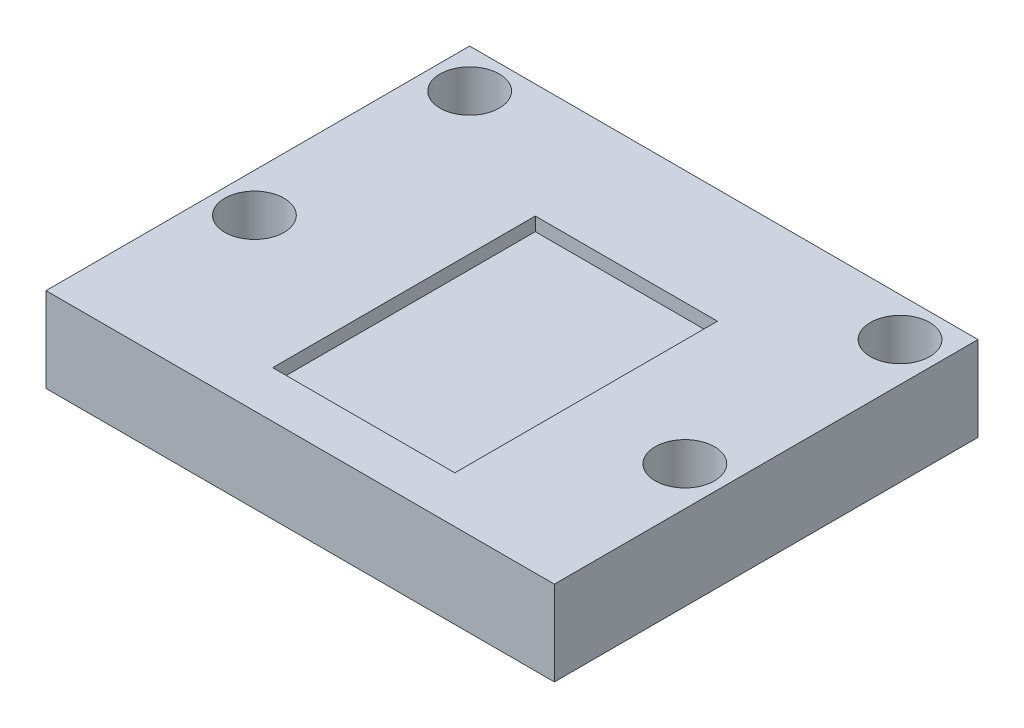
ISO-10303-21;
HEADER;
FILE_DESCRIPTION(('STEP AP214'),'2;1');
FILE_NAME('part.step','',(''),(''),'','','');
FILE_SCHEMA(('AUTOMOTIVE_DESIGN { 1 0 10303 214 1 1 1 1 }'));
ENDSEC;
DATA;
#1=APPLICATION_CONTEXT('core data for automotive mechanical design processes');
#2=APPLICATION_PROTOCOL_DEFINITION('international standard','automotive_design',2000,#1);
#3=PRODUCT_CONTEXT('',#1,'mechanical');
#4=PRODUCT('Part','Part','',(#3));
#5=PRODUCT_RELATED_PRODUCT_CATEGORY('part','',(#4));
#6=PRODUCT_DEFINITION_FORMATION('','',#4);
#7=PRODUCT_DEFINITION_CONTEXT('part definition',#1,'design');
#8=PRODUCT_DEFINITION('design','',#6,#7);
#9=PRODUCT_DEFINITION_SHAPE('','',#8);
#10=(LENGTH_UNIT() NAMED_UNIT(*) SI_UNIT(.MILLI.,.METRE.));
#11=(NAMED_UNIT(*) PLANE_ANGLE_UNIT() SI_UNIT($,.RADIAN.));
#12=(NAMED_UNIT(*) SI_UNIT($,.STERADIAN.) SOLID_ANGLE_UNIT());
#13=UNCERTAINTY_MEASURE_WITH_UNIT(LENGTH_MEASURE(1.E-05),#10,'distance_accuracy_value','');
#14=(GEOMETRIC_REPRESENTATION_CONTEXT(3) GLOBAL_UNCERTAINTY_ASSIGNED_CONTEXT((#13)) GLOBAL_UNIT_ASSIGNED_CONTEXT((#10,
#11,#12)) REPRESENTATION_CONTEXT('',''));
#15=CARTESIAN_POINT('',(0.,0.,0.));
#16=DIRECTION('',(0.,0.,1.));
#17=DIRECTION('',(1.,0.,0.));
#18=AXIS2_PLACEMENT_3D('',#15,#16,#17);
#19=CARTESIAN_POINT('',(0.,10.,0.));
#20=DIRECTION('',(1.,0.,0.));
#21=DIRECTION('',(0.,0.,-1.));
#22=AXIS2_PLACEMENT_3D('',#19,#20,#21);
#23=PLANE('',#22);
#24=DIRECTION('',(0.,0.,1.));
#25=VECTOR('',#24,1.);
#26=CARTESIAN_POINT('',(0.,0.,0.));
#27=LINE('',#26,#25);
#28=CARTESIAN_POINT('',(0.,0.,-50.));
#29=VERTEX_POINT('',#28);
#30=CARTESIAN_POINT('',(0.,0.,0.));
#31=VERTEX_POINT('',#30);
#32=EDGE_CURVE('E195',#29,#31,#27,.T.);
#33=ORIENTED_EDGE('',*,*,#32,.T.);
#34=DIRECTION('',(0.,-1.,0.));
#35=VECTOR('',#34,1.);
#36=CARTESIAN_POINT('',(0.,10.,0.));
#37=LINE('',#36,#35);
#38=CARTESIAN_POINT('',(0.,10.,0.));
#39=VERTEX_POINT('',#38);
#40=EDGE_CURVE('E11',#39,#31,#37,.T.);
#41=ORIENTED_EDGE('',*,*,#40,.F.);
#42=DIRECTION('',(0.,0.,1.));
#43=VECTOR('',#42,1.);
#44=CARTESIAN_POINT('',(0.,10.,0.));
#45=LINE('',#44,#43);
#46=CARTESIAN_POINT('',(0.,10.,-50.));
#47=VERTEX_POINT('',#46);
#48=EDGE_CURVE('E199',#47,#39,#45,.T.);
#49=ORIENTED_EDGE('',*,*,#48,.F.);
#50=DIRECTION('',(0.,-1.,0.));
#51=VECTOR('',#50,1.);
#52=CARTESIAN_POINT('',(0.,10.,-50.));
#53=LINE('',#52,#51);
#54=EDGE_CURVE('E209',#47,#29,#53,.T.);
#55=ORIENTED_EDGE('',*,*,#54,.T.);
#56=EDGE_LOOP('',(#33,#41,#49,#55));
#57=FACE_BOUND('',#56,.T.);
#58=ADVANCED_FACE('F42',(#57),#23,.F.);
#59=CARTESIAN_POINT('',(0.,10.,0.));
#60=DIRECTION('',(0.,0.,-1.));
#61=DIRECTION('',(-1.,0.,0.));
#62=AXIS2_PLACEMENT_3D('',#59,#60,#61);
#63=PLANE('',#62);
#64=DIRECTION('',(1.,0.,0.));
#65=VECTOR('',#64,1.);
#66=CARTESIAN_POINT('',(0.,0.,0.));
#67=LINE('',#66,#65);
#68=CARTESIAN_POINT('',(60.,0.,0.));
#69=VERTEX_POINT('',#68);
#70=EDGE_CURVE('E213',#31,#69,#67,.T.);
#71=ORIENTED_EDGE('',*,*,#70,.T.);
#72=DIRECTION('',(0.,-1.,0.));
#73=VECTOR('',#72,1.);
#74=CARTESIAN_POINT('',(60.,10.,0.));
#75=LINE('',#74,#73);
#76=CARTESIAN_POINT('',(60.,10.,0.));
#77=VERTEX_POINT('',#76);
#78=EDGE_CURVE('E50',#77,#69,#75,.T.);
#79=ORIENTED_EDGE('',*,*,#78,.F.);
#80=DIRECTION('',(1.,0.,0.));
#81=VECTOR('',#80,1.);
#82=CARTESIAN_POINT('',(0.,10.,0.));
#83=LINE('',#82,#81);
#84=EDGE_CURVE('E94',#39,#77,#83,.T.);
#85=ORIENTED_EDGE('',*,*,#84,.F.);
#86=ORIENTED_EDGE('',*,*,#40,.T.);
#87=EDGE_LOOP('',(#71,#79,#85,#86));
#88=FACE_BOUND('',#87,.T.);
#89=ADVANCED_FACE('F248',(#88),#63,.F.);
#90=CARTESIAN_POINT('',(60.,10.,0.));
#91=DIRECTION('',(-1.,0.,0.));
#92=DIRECTION('',(0.,0.,1.));
#93=AXIS2_PLACEMENT_3D('',#90,#91,#92);
#94=PLANE('',#93);
#95=DIRECTION('',(0.,0.,-1.));
#96=VECTOR('',#95,1.);
#97=CARTESIAN_POINT('',(60.,0.,0.));
#98=LINE('',#97,#96);
#99=CARTESIAN_POINT('',(60.,0.,-50.));
#100=VERTEX_POINT('',#99);
#101=EDGE_CURVE('E216',#69,#100,#98,.T.);
#102=ORIENTED_EDGE('',*,*,#101,.T.);
#103=DIRECTION('',(0.,-1.,0.));
#104=VECTOR('',#103,1.);
#105=CARTESIAN_POINT('',(60.,10.,-50.));
#106=LINE('',#105,#104);
#107=CARTESIAN_POINT('',(60.,10.,-50.));
#108=VERTEX_POINT('',#107);
#109=EDGE_CURVE('E223',#108,#100,#106,.T.);
#110=ORIENTED_EDGE('',*,*,#109,.F.);
#111=DIRECTION('',(0.,0.,-1.));
#112=VECTOR('',#111,1.);
#113=CARTESIAN_POINT('',(60.,10.,0.));
#114=LINE('',#113,#112);
#115=EDGE_CURVE('E204',#77,#108,#114,.T.);
#116=ORIENTED_EDGE('',*,*,#115,.F.);
#117=ORIENTED_EDGE('',*,*,#78,.T.);
#118=EDGE_LOOP('',(#102,#110,#116,#117));
#119=FACE_BOUND('',#118,.T.);
#120=ADVANCED_FACE('F230',(#119),#94,.F.);
#121=CARTESIAN_POINT('',(0.,10.,-50.));
#122=DIRECTION('',(0.,0.,1.));
#123=DIRECTION('',(1.,0.,0.));
#124=AXIS2_PLACEMENT_3D('',#121,#122,#123);
#125=PLANE('',#124);
#126=DIRECTION('',(-1.,0.,0.));
#127=VECTOR('',#126,1.);
#128=CARTESIAN_POINT('',(0.,0.,-50.));
#129=LINE('',#128,#127);
#130=EDGE_CURVE('E87',#100,#29,#129,.T.);
#131=ORIENTED_EDGE('',*,*,#130,.T.);
#132=ORIENTED_EDGE('',*,*,#54,.F.);
#133=DIRECTION('',(-1.,0.,0.));
#134=VECTOR('',#133,1.);
#135=CARTESIAN_POINT('',(0.,10.,-50.));
#136=LINE('',#135,#134);
#137=EDGE_CURVE('E66',#108,#47,#136,.T.);
#138=ORIENTED_EDGE('',*,*,#137,.F.);
#139=ORIENTED_EDGE('',*,*,#109,.T.);
#140=EDGE_LOOP('',(#131,#132,#138,#139));
#141=FACE_BOUND('',#140,.T.);
#142=ADVANCED_FACE('F238',(#141),#125,.F.);
#143=CARTESIAN_POINT('',(0.,10.,0.));
#144=DIRECTION('',(0.,-1.,0.));
#145=DIRECTION('',(0.,0.,-1.));
#146=AXIS2_PLACEMENT_3D('',#143,#144,#145);
#147=PLANE('',#146);
#148=DIRECTION('',(1.,0.,0.));
#149=VECTOR('',#148,1.);
#150=CARTESIAN_POINT('',(21.25,10.,-5.50000000000002));
#151=LINE('',#150,#149);
#152=CARTESIAN_POINT('',(21.25,10.,-5.50000000000002));
#153=VERTEX_POINT('',#152);
#154=CARTESIAN_POINT('',(42.75,10.,-5.50000000000001));
#155=VERTEX_POINT('',#154);
#156=EDGE_CURVE('E152',#153,#155,#151,.T.);
#157=ORIENTED_EDGE('',*,*,#156,.F.);
#158=DIRECTION('',(0.,0.,1.));
#159=VECTOR('',#158,1.);
#160=CARTESIAN_POINT('',(21.25,10.,-36.5));
#161=LINE('',#160,#159);
#162=CARTESIAN_POINT('',(21.25,10.,-36.5));
#163=VERTEX_POINT('',#162);
#164=EDGE_CURVE('E57',#163,#153,#161,.T.);
#165=ORIENTED_EDGE('',*,*,#164,.F.);
#166=DIRECTION('',(-1.,0.,0.));
#167=VECTOR('',#166,1.);
#168=CARTESIAN_POINT('',(21.25,10.,-36.5));
#169=LINE('',#168,#167);
#170=CARTESIAN_POINT('',(42.75,10.,-36.5));
#171=VERTEX_POINT('',#170);
#172=EDGE_CURVE('E139',#171,#163,#169,.T.);
#173=ORIENTED_EDGE('',*,*,#172,.F.);
#174=DIRECTION('',(0.,0.,-1.));
#175=VECTOR('',#174,1.);
#176=CARTESIAN_POINT('',(42.75,10.,-36.5));
#177=LINE('',#176,#175);
#178=EDGE_CURVE('E143',#155,#171,#177,.T.);
#179=ORIENTED_EDGE('',*,*,#178,.F.);
#180=EDGE_LOOP('',(#157,#165,#173,#179));
#181=FACE_BOUND('',#180,.T.);
#182=CARTESIAN_POINT('',(55.4,10.,-45.4));
#183=DIRECTION('',(0.,1.,0.));
#184=DIRECTION('',(0.,0.,1.));
#185=AXIS2_PLACEMENT_3D('',#182,#183,#184);
#186=CIRCLE('',#185,3.5);
#187=CARTESIAN_POINT('',(55.4,10.,-41.9));
#188=VERTEX_POINT('',#187);
#189=EDGE_CURVE('E180',#188,#188,#186,.T.);
#190=ORIENTED_EDGE('',*,*,#189,.F.);
#191=EDGE_LOOP('',(#190));
#192=FACE_BOUND('',#191,.T.);
#193=CARTESIAN_POINT('',(4.6,10.,-20.));
#194=DIRECTION('',(0.,1.,0.));
#195=DIRECTION('',(0.,0.,1.));
#196=AXIS2_PLACEMENT_3D('',#193,#194,#195);
#197=CIRCLE('',#196,3.5);
#198=CARTESIAN_POINT('',(4.6,10.,-16.5));
#199=VERTEX_POINT('',#198);
#200=EDGE_CURVE('E171',#199,#199,#197,.T.);
#201=ORIENTED_EDGE('',*,*,#200,.F.);
#202=EDGE_LOOP('',(#201));
#203=FACE_BOUND('',#202,.T.);
#204=CARTESIAN_POINT('',(55.4,10.,-20.));
#205=DIRECTION('',(0.,1.,0.));
#206=DIRECTION('',(0.,0.,1.));
#207=AXIS2_PLACEMENT_3D('',#204,#205,#206);
#208=CIRCLE('',#207,3.5);
#209=CARTESIAN_POINT('',(55.4,10.,-16.5));
#210=VERTEX_POINT('',#209);
#211=EDGE_CURVE('E161',#210,#210,#208,.T.);
#212=ORIENTED_EDGE('',*,*,#211,.F.);
#213=EDGE_LOOP('',(#212));
#214=FACE_BOUND('',#213,.T.);
#215=CARTESIAN_POINT('',(4.6,10.,-45.4));
#216=DIRECTION('',(0.,1.,0.));
#217=DIRECTION('',(0.,0.,1.));
#218=AXIS2_PLACEMENT_3D('',#215,#216,#217);
#219=CIRCLE('',#218,3.50000000000001);
#220=CARTESIAN_POINT('',(4.6,10.,-41.9));
#221=VERTEX_POINT('',#220);
#222=EDGE_CURVE('E179',#221,#221,#219,.T.);
#223=ORIENTED_EDGE('',*,*,#222,.F.);
#224=EDGE_LOOP('',(#223));
#225=FACE_BOUND('',#224,.T.);
#226=ORIENTED_EDGE('',*,*,#48,.T.);
#227=ORIENTED_EDGE('',*,*,#84,.T.);
#228=ORIENTED_EDGE('',*,*,#115,.T.);
#229=ORIENTED_EDGE('',*,*,#137,.T.);
#230=EDGE_LOOP('',(#226,#227,#228,#229));
#231=FACE_BOUND('',#230,.T.);
#232=ADVANCED_FACE('F240',(#181,#192,#203,#214,#225,#231),#147,.F.);
#233=CARTESIAN_POINT('',(0.,0.,0.));
#234=DIRECTION('',(0.,-1.,0.));
#235=DIRECTION('',(0.,0.,-1.));
#236=AXIS2_PLACEMENT_3D('',#233,#234,#235);
#237=PLANE('',#236);
#238=CARTESIAN_POINT('',(55.4,0.,-45.4));
#239=DIRECTION('',(0.,1.,0.));
#240=DIRECTION('',(0.,0.,1.));
#241=AXIS2_PLACEMENT_3D('',#238,#239,#240);
#242=CIRCLE('',#241,3.5);
#243=CARTESIAN_POINT('',(55.4,0.,-41.9));
#244=VERTEX_POINT('',#243);
#245=EDGE_CURVE('E175',#244,#244,#242,.T.);
#246=ORIENTED_EDGE('',*,*,#245,.T.);
#247=EDGE_LOOP('',(#246));
#248=FACE_BOUND('',#247,.T.);
#249=CARTESIAN_POINT('',(4.6,0.,-20.));
#250=DIRECTION('',(0.,1.,0.));
#251=DIRECTION('',(0.,0.,1.));
#252=AXIS2_PLACEMENT_3D('',#249,#250,#251);
#253=CIRCLE('',#252,3.5);
#254=CARTESIAN_POINT('',(4.6,0.,-16.5));
#255=VERTEX_POINT('',#254);
#256=EDGE_CURVE('E184',#255,#255,#253,.T.);
#257=ORIENTED_EDGE('',*,*,#256,.T.);
#258=EDGE_LOOP('',(#257));
#259=FACE_BOUND('',#258,.T.);
#260=CARTESIAN_POINT('',(55.4,0.,-20.));
#261=DIRECTION('',(0.,1.,0.));
#262=DIRECTION('',(0.,0.,1.));
#263=AXIS2_PLACEMENT_3D('',#260,#261,#262);
#264=CIRCLE('',#263,3.5);
#265=CARTESIAN_POINT('',(55.4,0.,-16.5));
#266=VERTEX_POINT('',#265);
#267=EDGE_CURVE('E167',#266,#266,#264,.T.);
#268=ORIENTED_EDGE('',*,*,#267,.T.);
#269=EDGE_LOOP('',(#268));
#270=FACE_BOUND('',#269,.T.);
#271=CARTESIAN_POINT('',(4.6,0.,-45.4));
#272=DIRECTION('',(0.,1.,0.));
#273=DIRECTION('',(0.,0.,1.));
#274=AXIS2_PLACEMENT_3D('',#271,#272,#273);
#275=CIRCLE('',#274,3.50000000000001);
#276=CARTESIAN_POINT('',(4.6,0.,-41.9));
#277=VERTEX_POINT('',#276);
#278=EDGE_CURVE('E191',#277,#277,#275,.T.);
#279=ORIENTED_EDGE('',*,*,#278,.T.);
#280=EDGE_LOOP('',(#279));
#281=FACE_BOUND('',#280,.T.);
#282=ORIENTED_EDGE('',*,*,#32,.F.);
#283=ORIENTED_EDGE('',*,*,#130,.F.);
#284=ORIENTED_EDGE('',*,*,#101,.F.);
#285=ORIENTED_EDGE('',*,*,#70,.F.);
#286=EDGE_LOOP('',(#282,#283,#284,#285));
#287=FACE_BOUND('',#286,.T.);
#288=ADVANCED_FACE('F234',(#248,#259,#270,#281,#287),#237,.T.);
#289=CARTESIAN_POINT('',(4.6,0.,-45.4));
#290=DIRECTION('',(0.,1.,0.));
#291=DIRECTION('',(0.,0.,1.));
#292=AXIS2_PLACEMENT_3D('',#289,#290,#291);
#293=CYLINDRICAL_SURFACE('',#292,3.50000000000001);
#294=ORIENTED_EDGE('',*,*,#278,.F.);
#295=EDGE_LOOP('',(#294));
#296=FACE_BOUND('',#295,.T.);
#297=ORIENTED_EDGE('',*,*,#222,.T.);
#298=EDGE_LOOP('',(#297));
#299=FACE_BOUND('',#298,.T.);
#300=ADVANCED_FACE('F277',(#296,#299),#293,.F.);
#301=CARTESIAN_POINT('',(55.4,0.,-20.));
#302=DIRECTION('',(0.,1.,0.));
#303=DIRECTION('',(0.,0.,1.));
#304=AXIS2_PLACEMENT_3D('',#301,#302,#303);
#305=CYLINDRICAL_SURFACE('',#304,3.5);
#306=ORIENTED_EDGE('',*,*,#267,.F.);
#307=EDGE_LOOP('',(#306));
#308=FACE_BOUND('',#307,.T.);
#309=ORIENTED_EDGE('',*,*,#211,.T.);
#310=EDGE_LOOP('',(#309));
#311=FACE_BOUND('',#310,.T.);
#312=ADVANCED_FACE('F287',(#308,#311),#305,.F.);
#313=CARTESIAN_POINT('',(4.6,0.,-20.));
#314=DIRECTION('',(0.,1.,0.));
#315=DIRECTION('',(0.,0.,1.));
#316=AXIS2_PLACEMENT_3D('',#313,#314,#315);
#317=CYLINDRICAL_SURFACE('',#316,3.5);
#318=ORIENTED_EDGE('',*,*,#256,.F.);
#319=EDGE_LOOP('',(#318));
#320=FACE_BOUND('',#319,.T.);
#321=ORIENTED_EDGE('',*,*,#200,.T.);
#322=EDGE_LOOP('',(#321));
#323=FACE_BOUND('',#322,.T.);
#324=ADVANCED_FACE('F298',(#320,#323),#317,.F.);
#325=CARTESIAN_POINT('',(55.4,0.,-45.4));
#326=DIRECTION('',(0.,1.,0.));
#327=DIRECTION('',(0.,0.,1.));
#328=AXIS2_PLACEMENT_3D('',#325,#326,#327);
#329=CYLINDRICAL_SURFACE('',#328,3.5);
#330=ORIENTED_EDGE('',*,*,#245,.F.);
#331=EDGE_LOOP('',(#330));
#332=FACE_BOUND('',#331,.T.);
#333=ORIENTED_EDGE('',*,*,#189,.T.);
#334=EDGE_LOOP('',(#333));
#335=FACE_BOUND('',#334,.T.);
#336=ADVANCED_FACE('F309',(#332,#335),#329,.F.);
#337=CARTESIAN_POINT('',(21.25,8.4,-36.5));
#338=DIRECTION('',(-1.,0.,0.));
#339=DIRECTION('',(0.,0.,1.));
#340=AXIS2_PLACEMENT_3D('',#337,#338,#339);
#341=PLANE('',#340);
#342=ORIENTED_EDGE('',*,*,#164,.T.);
#343=DIRECTION('',(0.,1.,0.));
#344=VECTOR('',#343,1.);
#345=CARTESIAN_POINT('',(21.25,8.4,-5.50000000000002));
#346=LINE('',#345,#344);
#347=CARTESIAN_POINT('',(21.25,8.4,-5.50000000000002));
#348=VERTEX_POINT('',#347);
#349=EDGE_CURVE('E114',#348,#153,#346,.T.);
#350=ORIENTED_EDGE('',*,*,#349,.F.);
#351=DIRECTION('',(0.,0.,1.));
#352=VECTOR('',#351,1.);
#353=CARTESIAN_POINT('',(21.25,8.4,-36.5));
#354=LINE('',#353,#352);
#355=CARTESIAN_POINT('',(21.25,8.4,-36.5));
#356=VERTEX_POINT('',#355);
#357=EDGE_CURVE('E118',#356,#348,#354,.T.);
#358=ORIENTED_EDGE('',*,*,#357,.F.);
#359=DIRECTION('',(0.,1.,0.));
#360=VECTOR('',#359,1.);
#361=CARTESIAN_POINT('',(21.25,8.4,-36.5));
#362=LINE('',#361,#360);
#363=EDGE_CURVE('E158',#356,#163,#362,.T.);
#364=ORIENTED_EDGE('',*,*,#363,.T.);
#365=EDGE_LOOP('',(#342,#350,#358,#364));
#366=FACE_BOUND('',#365,.T.);
#367=ADVANCED_FACE('F116',(#366),#341,.F.);
#368=CARTESIAN_POINT('',(21.25,8.4,-36.5));
#369=DIRECTION('',(0.,0.,-1.));
#370=DIRECTION('',(-1.,0.,0.));
#371=AXIS2_PLACEMENT_3D('',#368,#369,#370);
#372=PLANE('',#371);
#373=ORIENTED_EDGE('',*,*,#172,.T.);
#374=ORIENTED_EDGE('',*,*,#363,.F.);
#375=DIRECTION('',(-1.,0.,0.));
#376=VECTOR('',#375,1.);
#377=CARTESIAN_POINT('',(21.25,8.4,-36.5));
#378=LINE('',#377,#376);
#379=CARTESIAN_POINT('',(42.75,8.4,-36.5));
#380=VERTEX_POINT('',#379);
#381=EDGE_CURVE('E125',#380,#356,#378,.T.);
#382=ORIENTED_EDGE('',*,*,#381,.F.);
#383=DIRECTION('',(0.,1.,0.));
#384=VECTOR('',#383,1.);
#385=CARTESIAN_POINT('',(42.75,8.4,-36.5));
#386=LINE('',#385,#384);
#387=EDGE_CURVE('E162',#380,#171,#386,.T.);
#388=ORIENTED_EDGE('',*,*,#387,.T.);
#389=EDGE_LOOP('',(#373,#374,#382,#388));
#390=FACE_BOUND('',#389,.T.);
#391=ADVANCED_FACE('F336',(#390),#372,.F.);
#392=CARTESIAN_POINT('',(42.75,8.4,-36.5));
#393=DIRECTION('',(1.,0.,0.));
#394=DIRECTION('',(0.,0.,-1.));
#395=AXIS2_PLACEMENT_3D('',#392,#393,#394);
#396=PLANE('',#395);
#397=ORIENTED_EDGE('',*,*,#178,.T.);
#398=ORIENTED_EDGE('',*,*,#387,.F.);
#399=DIRECTION('',(0.,0.,-1.));
#400=VECTOR('',#399,1.);
#401=CARTESIAN_POINT('',(42.75,8.4,-36.5));
#402=LINE('',#401,#400);
#403=CARTESIAN_POINT('',(42.75,8.4,-5.50000000000001));
#404=VERTEX_POINT('',#403);
#405=EDGE_CURVE('E134',#404,#380,#402,.T.);
#406=ORIENTED_EDGE('',*,*,#405,.F.);
#407=DIRECTION('',(0.,1.,0.));
#408=VECTOR('',#407,1.);
#409=CARTESIAN_POINT('',(42.75,8.4,-5.50000000000001));
#410=LINE('',#409,#408);
#411=EDGE_CURVE('E124',#404,#155,#410,.T.);
#412=ORIENTED_EDGE('',*,*,#411,.T.);
#413=EDGE_LOOP('',(#397,#398,#406,#412));
#414=FACE_BOUND('',#413,.T.);
#415=ADVANCED_FACE('F346',(#414),#396,.F.);
#416=CARTESIAN_POINT('',(21.25,8.4,-5.50000000000002));
#417=DIRECTION('',(0.,0.,1.));
#418=DIRECTION('',(1.,0.,0.));
#419=AXIS2_PLACEMENT_3D('',#416,#417,#418);
#420=PLANE('',#419);
#421=ORIENTED_EDGE('',*,*,#156,.T.);
#422=ORIENTED_EDGE('',*,*,#411,.F.);
#423=DIRECTION('',(1.,0.,0.));
#424=VECTOR('',#423,1.);
#425=CARTESIAN_POINT('',(21.25,8.4,-5.50000000000002));
#426=LINE('',#425,#424);
#427=EDGE_CURVE('E128',#348,#404,#426,.T.);
#428=ORIENTED_EDGE('',*,*,#427,.F.);
#429=ORIENTED_EDGE('',*,*,#349,.T.);
#430=EDGE_LOOP('',(#421,#422,#428,#429));
#431=FACE_BOUND('',#430,.T.);
#432=ADVANCED_FACE('F129',(#431),#420,.F.);
#433=CARTESIAN_POINT('',(0.,8.4,0.));
#434=DIRECTION('',(0.,1.,0.));
#435=DIRECTION('',(0.,0.,1.));
#436=AXIS2_PLACEMENT_3D('',#433,#434,#435);
#437=PLANE('',#436);
#438=ORIENTED_EDGE('',*,*,#357,.T.);
#439=ORIENTED_EDGE('',*,*,#427,.T.);
#440=ORIENTED_EDGE('',*,*,#405,.T.);
#441=ORIENTED_EDGE('',*,*,#381,.T.);
#442=EDGE_LOOP('',(#438,#439,#440,#441));
#443=FACE_BOUND('',#442,.T.);
#444=ADVANCED_FACE('F136',(#443),#437,.T.);
#445=CLOSED_SHELL('',(#58,#89,#120,#142,#232,#288,#300,#312,#324,#336,#367,#391,#415,#432,#444));
#446=MANIFOLD_SOLID_BREP('B2',#445);
#447=ADVANCED_BREP_SHAPE_REPRESENTATION('',(#18,#446),#14);
#448=SHAPE_DEFINITION_REPRESENTATION(#9,#447);
ENDSEC;
END-ISO-10303-21;
